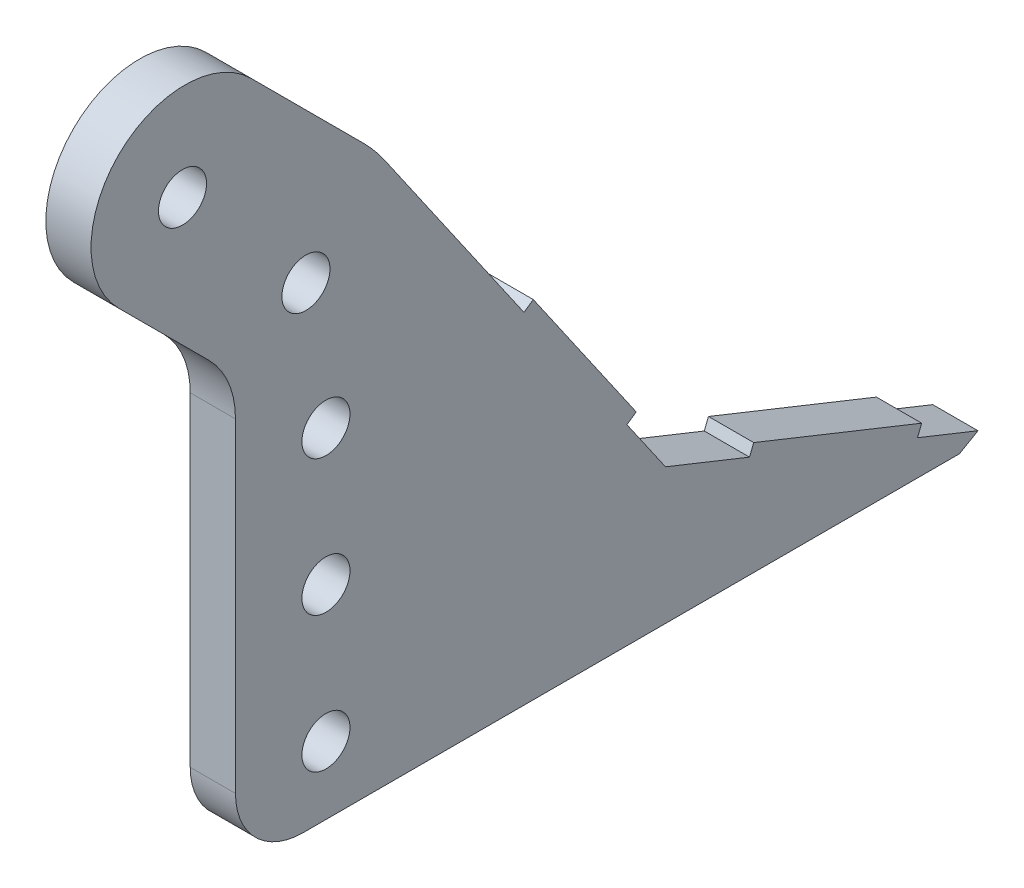
ISO-10303-21;
HEADER;
FILE_DESCRIPTION(('STEP AP214'),'2;1');
FILE_NAME('part.step','',(''),(''),'','','');
FILE_SCHEMA(('AUTOMOTIVE_DESIGN { 1 0 10303 214 1 1 1 1 }'));
ENDSEC;
DATA;
#1=APPLICATION_CONTEXT('core data for automotive mechanical design processes');
#2=APPLICATION_PROTOCOL_DEFINITION('international standard','automotive_design',2000,#1);
#3=PRODUCT_CONTEXT('',#1,'mechanical');
#4=PRODUCT('Part','Part','',(#3));
#5=PRODUCT_RELATED_PRODUCT_CATEGORY('part','',(#4));
#6=PRODUCT_DEFINITION_FORMATION('','',#4);
#7=PRODUCT_DEFINITION_CONTEXT('part definition',#1,'design');
#8=PRODUCT_DEFINITION('design','',#6,#7);
#9=PRODUCT_DEFINITION_SHAPE('','',#8);
#10=(LENGTH_UNIT() NAMED_UNIT(*) SI_UNIT(.MILLI.,.METRE.));
#11=(NAMED_UNIT(*) PLANE_ANGLE_UNIT() SI_UNIT($,.RADIAN.));
#12=(NAMED_UNIT(*) SI_UNIT($,.STERADIAN.) SOLID_ANGLE_UNIT());
#13=UNCERTAINTY_MEASURE_WITH_UNIT(LENGTH_MEASURE(1.E-05),#10,'distance_accuracy_value','');
#14=(GEOMETRIC_REPRESENTATION_CONTEXT(3) GLOBAL_UNCERTAINTY_ASSIGNED_CONTEXT((#13)) GLOBAL_UNIT_ASSIGNED_CONTEXT((#10,
#11,#12)) REPRESENTATION_CONTEXT('',''));
#15=CARTESIAN_POINT('',(0.,0.,0.));
#16=DIRECTION('',(0.,0.,1.));
#17=DIRECTION('',(1.,0.,0.));
#18=AXIS2_PLACEMENT_3D('',#15,#16,#17);
#19=CARTESIAN_POINT('',(-231.198104913253,-254.,-555.730407277116));
#20=DIRECTION('',(0.,0.928476690885259,-0.371390676354104));
#21=DIRECTION('',(0.,0.371390676354104,0.928476690885259));
#22=AXIS2_PLACEMENT_3D('',#19,#20,#21);
#23=PLANE('',#22);
#24=DIRECTION('',(1.,0.,0.));
#25=VECTOR('',#24,1.);
#26=CARTESIAN_POINT('',(-53.7828468557932,-225.333323179394,-484.063715225601));
#27=LINE('',#26,#25);
#28=CARTESIAN_POINT('',(0.,-225.333323179394,-484.063715225601));
#29=VERTEX_POINT('',#28);
#30=CARTESIAN_POINT('',(12.7,-225.333323179394,-484.063715225601));
#31=VERTEX_POINT('',#30);
#32=EDGE_CURVE('E402',#29,#31,#27,.T.);
#33=ORIENTED_EDGE('',*,*,#32,.F.);
#34=DIRECTION('',(0.,-0.371390676354104,-0.928476690885259));
#35=VECTOR('',#34,1.);
#36=CARTESIAN_POINT('',(0.,-254.,-555.730407277116));
#37=LINE('',#36,#35);
#38=CARTESIAN_POINT('',(0.,-215.9,-460.480407277116));
#39=VERTEX_POINT('',#38);
#40=EDGE_CURVE('E221',#39,#29,#37,.T.);
#41=ORIENTED_EDGE('',*,*,#40,.F.);
#42=DIRECTION('',(1.,0.,0.));
#43=VECTOR('',#42,1.);
#44=CARTESIAN_POINT('',(-231.198104913253,-215.9,-460.480407277116));
#45=LINE('',#44,#43);
#46=CARTESIAN_POINT('',(12.7,-215.9,-460.480407277116));
#47=VERTEX_POINT('',#46);
#48=EDGE_CURVE('E232',#39,#47,#45,.T.);
#49=ORIENTED_EDGE('',*,*,#48,.T.);
#50=DIRECTION('',(0.,0.371390676354104,0.928476690885259));
#51=VECTOR('',#50,1.);
#52=CARTESIAN_POINT('',(12.7,-254.,-555.730407277116));
#53=LINE('',#52,#51);
#54=EDGE_CURVE('E171',#31,#47,#53,.T.);
#55=ORIENTED_EDGE('',*,*,#54,.F.);
#56=EDGE_LOOP('',(#33,#41,#49,#55));
#57=FACE_BOUND('',#56,.T.);
#58=ADVANCED_FACE('F36',(#57),#23,.T.);
#59=CARTESIAN_POINT('',(-231.198104913253,-215.9,-460.480407277116));
#60=DIRECTION('',(0.,0.568989669090056,-0.822344670116362));
#61=DIRECTION('',(0.,0.822344670116362,0.568989669090056));
#62=AXIS2_PLACEMENT_3D('',#59,#60,#61);
#63=PLANE('',#62);
#64=DIRECTION('',(1.,0.,0.));
#65=VECTOR('',#64,1.);
#66=CARTESIAN_POINT('',(-53.7828468557932,-158.459224792372,-420.736478891175));
#67=LINE('',#66,#65);
#68=CARTESIAN_POINT('',(0.,-158.459224792372,-420.736478891175));
#69=VERTEX_POINT('',#68);
#70=CARTESIAN_POINT('',(12.7,-158.459224792372,-420.736478891175));
#71=VERTEX_POINT('',#70);
#72=EDGE_CURVE('E200',#69,#71,#67,.T.);
#73=ORIENTED_EDGE('',*,*,#72,.F.);
#74=DIRECTION('',(0.,-0.822344670116362,-0.568989669090056));
#75=VECTOR('',#74,1.);
#76=CARTESIAN_POINT('',(0.,-215.9,-460.480407277116));
#77=LINE('',#76,#75);
#78=CARTESIAN_POINT('',(0.,-101.904352021621,-381.605516519027));
#79=VERTEX_POINT('',#78);
#80=EDGE_CURVE('E225',#79,#69,#77,.T.);
#81=ORIENTED_EDGE('',*,*,#80,.F.);
#82=DIRECTION('',(1.,0.,0.));
#83=VECTOR('',#82,1.);
#84=CARTESIAN_POINT('',(-231.198104913253,-101.904352021621,-381.605516519027));
#85=LINE('',#84,#83);
#86=CARTESIAN_POINT('',(12.7,-101.904352021621,-381.605516519027));
#87=VERTEX_POINT('',#86);
#88=EDGE_CURVE('E233',#79,#87,#85,.T.);
#89=ORIENTED_EDGE('',*,*,#88,.T.);
#90=DIRECTION('',(0.,0.822344670116362,0.568989669090056));
#91=VECTOR('',#90,1.);
#92=CARTESIAN_POINT('',(12.7,-215.9,-460.480407277116));
#93=LINE('',#92,#91);
#94=EDGE_CURVE('E170',#71,#87,#93,.T.);
#95=ORIENTED_EDGE('',*,*,#94,.F.);
#96=EDGE_LOOP('',(#73,#81,#89,#95));
#97=FACE_BOUND('',#96,.T.);
#98=ADVANCED_FACE('F350',(#97),#63,.T.);
#99=CARTESIAN_POINT('',(12.7,103.1875,-103.187499999999));
#100=DIRECTION('',(0.,0.707106781186549,-0.707106781186546));
#101=DIRECTION('',(0.,0.707106781186546,0.707106781186549));
#102=AXIS2_PLACEMENT_3D('',#99,#100,#101);
#103=PLANE('',#102);
#104=DIRECTION('',(1.,0.,0.));
#105=VECTOR('',#104,1.);
#106=CARTESIAN_POINT('',(0.,-100.510512242138,-306.885512242138));
#107=LINE('',#106,#105);
#108=CARTESIAN_POINT('',(0.,-100.510512242138,-306.885512242138));
#109=VERTEX_POINT('',#108);
#110=CARTESIAN_POINT('',(12.7,-100.510512242138,-306.885512242138));
#111=VERTEX_POINT('',#110);
#112=EDGE_CURVE('E243',#109,#111,#107,.T.);
#113=ORIENTED_EDGE('',*,*,#112,.F.);
#114=DIRECTION('',(0.,-0.707106781186546,-0.707106781186549));
#115=VECTOR('',#114,1.);
#116=CARTESIAN_POINT('',(0.,103.1875,-103.187499999999));
#117=LINE('',#116,#115);
#118=CARTESIAN_POINT('',(0.,-125.910512242138,-332.285512242138));
#119=VERTEX_POINT('',#118);
#120=EDGE_CURVE('E285',#109,#119,#117,.T.);
#121=ORIENTED_EDGE('',*,*,#120,.T.);
#122=DIRECTION('',(-1.,0.,0.));
#123=VECTOR('',#122,1.);
#124=CARTESIAN_POINT('',(12.7,-125.910512242138,-332.285512242138));
#125=LINE('',#124,#123);
#126=CARTESIAN_POINT('',(12.7,-125.910512242138,-332.285512242138));
#127=VERTEX_POINT('',#126);
#128=EDGE_CURVE('E297',#119,#127,#125,.F.);
#129=ORIENTED_EDGE('',*,*,#128,.T.);
#130=DIRECTION('',(0.,-0.707106781186546,-0.707106781186549));
#131=VECTOR('',#130,1.);
#132=CARTESIAN_POINT('',(12.7,103.1875,-103.187499999999));
#133=LINE('',#132,#131);
#134=EDGE_CURVE('E273',#111,#127,#133,.T.);
#135=ORIENTED_EDGE('',*,*,#134,.F.);
#136=EDGE_LOOP('',(#113,#121,#129,#135));
#137=FACE_BOUND('',#136,.T.);
#138=ADVANCED_FACE('F357',(#137),#103,.F.);
#139=CARTESIAN_POINT('',(12.7,0.,0.));
#140=DIRECTION('',(1.,0.,0.));
#141=DIRECTION('',(0.,0.,-1.));
#142=AXIS2_PLACEMENT_3D('',#139,#140,#141);
#143=PLANE('',#142);
#144=CARTESIAN_POINT('',(12.7,-82.55,-324.846024484277));
#145=DIRECTION('',(1.,0.,0.));
#146=DIRECTION('',(0.,0.,-1.));
#147=AXIS2_PLACEMENT_3D('',#144,#145,#146);
#148=CIRCLE('',#147,6.74624);
#149=CARTESIAN_POINT('',(12.7,-82.55,-331.592264484277));
#150=VERTEX_POINT('',#149);
#151=EDGE_CURVE('E269',#150,#150,#148,.T.);
#152=ORIENTED_EDGE('',*,*,#151,.F.);
#153=EDGE_LOOP('',(#152));
#154=FACE_BOUND('',#153,.T.);
#155=CARTESIAN_POINT('',(12.7,-120.65,-359.507120599864));
#156=DIRECTION('',(1.,0.,0.));
#157=DIRECTION('',(0.,0.,-1.));
#158=AXIS2_PLACEMENT_3D('',#155,#156,#157);
#159=CIRCLE('',#158,6.74624);
#160=CARTESIAN_POINT('',(12.7,-120.65,-366.253360599864));
#161=VERTEX_POINT('',#160);
#162=EDGE_CURVE('E263',#161,#161,#159,.T.);
#163=ORIENTED_EDGE('',*,*,#162,.F.);
#164=EDGE_LOOP('',(#163));
#165=FACE_BOUND('',#164,.T.);
#166=CARTESIAN_POINT('',(12.7,-158.75,-365.125));
#167=DIRECTION('',(1.,0.,0.));
#168=DIRECTION('',(0.,0.,-1.));
#169=AXIS2_PLACEMENT_3D('',#166,#167,#168);
#170=CIRCLE('',#169,6.74623999999999);
#171=CARTESIAN_POINT('',(12.7,-158.75,-371.87124));
#172=VERTEX_POINT('',#171);
#173=EDGE_CURVE('E259',#172,#172,#170,.T.);
#174=ORIENTED_EDGE('',*,*,#173,.F.);
#175=EDGE_LOOP('',(#174));
#176=FACE_BOUND('',#175,.T.);
#177=CARTESIAN_POINT('',(12.7,-196.85,-365.125));
#178=DIRECTION('',(1.,0.,0.));
#179=DIRECTION('',(0.,0.,-1.));
#180=AXIS2_PLACEMENT_3D('',#177,#178,#179);
#181=CIRCLE('',#180,6.74623999999999);
#182=CARTESIAN_POINT('',(12.7,-196.85,-371.87124));
#183=VERTEX_POINT('',#182);
#184=EDGE_CURVE('E253',#183,#183,#181,.T.);
#185=ORIENTED_EDGE('',*,*,#184,.F.);
#186=EDGE_LOOP('',(#185));
#187=FACE_BOUND('',#186,.T.);
#188=CARTESIAN_POINT('',(12.7,-234.95,-365.125));
#189=DIRECTION('',(1.,0.,0.));
#190=DIRECTION('',(0.,0.,-1.));
#191=AXIS2_PLACEMENT_3D('',#188,#189,#190);
#192=CIRCLE('',#191,6.74623999999999);
#193=CARTESIAN_POINT('',(12.7,-234.95,-371.87124));
#194=VERTEX_POINT('',#193);
#195=EDGE_CURVE('E245',#194,#194,#192,.T.);
#196=ORIENTED_EDGE('',*,*,#195,.F.);
#197=EDGE_LOOP('',(#196));
#198=FACE_BOUND('',#197,.T.);
#199=DIRECTION('',(0.,0.,-1.));
#200=VECTOR('',#199,1.);
#201=CARTESIAN_POINT('',(12.7,-254.,0.));
#202=LINE('',#201,#200);
#203=CARTESIAN_POINT('',(12.7,-254.,-358.775));
#204=VERTEX_POINT('',#203);
#205=CARTESIAN_POINT('',(12.7,-254.,-543.030407277116));
#206=VERTEX_POINT('',#205);
#207=EDGE_CURVE('E279',#204,#206,#202,.T.);
#208=ORIENTED_EDGE('',*,*,#207,.T.);
#209=DIRECTION('',(0.,0.500000000000001,-0.866025403784438));
#210=VECTOR('',#209,1.);
#211=CARTESIAN_POINT('',(12.7,-425.639063864696,-245.742828099903));
#212=LINE('',#211,#210);
#213=CARTESIAN_POINT('',(12.7,-250.999090848038,-548.228134397212));
#214=VERTEX_POINT('',#213);
#215=EDGE_CURVE('E58',#206,#214,#212,.T.);
#216=ORIENTED_EDGE('',*,*,#215,.T.);
#217=CARTESIAN_POINT('',(12.7,-244.199969538183,-531.230331122572));
#218=VERTEX_POINT('',#217);
#219=EDGE_CURVE('E164',#214,#218,#53,.T.);
#220=ORIENTED_EDGE('',*,*,#219,.T.);
#221=DIRECTION('',(0.,0.928476690885218,-0.371390676354206));
#222=VECTOR('',#221,1.);
#223=CARTESIAN_POINT('',(12.7,-241.252056044622,-532.409496519997));
#224=LINE('',#223,#222);
#225=CARTESIAN_POINT('',(12.7,-241.252056044622,-532.409496519997));
#226=VERTEX_POINT('',#225);
#227=EDGE_CURVE('E168',#218,#226,#224,.T.);
#228=ORIENTED_EDGE('',*,*,#227,.T.);
#229=DIRECTION('',(0.,0.371390676354105,0.928476690885259));
#230=VECTOR('',#229,1.);
#231=CARTESIAN_POINT('',(12.7,-222.385409685834,-485.242880623026));
#232=LINE('',#231,#230);
#233=CARTESIAN_POINT('',(12.7,-222.385409685834,-485.242880623026));
#234=VERTEX_POINT('',#233);
#235=EDGE_CURVE('E181',#226,#234,#232,.T.);
#236=ORIENTED_EDGE('',*,*,#235,.T.);
#237=DIRECTION('',(0.,-0.928476690885257,0.37139067635411));
#238=VECTOR('',#237,1.);
#239=CARTESIAN_POINT('',(12.7,-225.333323179394,-484.063715225601));
#240=LINE('',#239,#238);
#241=EDGE_CURVE('E185',#234,#31,#240,.T.);
#242=ORIENTED_EDGE('',*,*,#241,.T.);
#243=ORIENTED_EDGE('',*,*,#54,.T.);
#244=CARTESIAN_POINT('',(12.7,-200.234334034283,-449.64115408095));
#245=VERTEX_POINT('',#244);
#246=EDGE_CURVE('E229',#47,#245,#93,.T.);
#247=ORIENTED_EDGE('',*,*,#246,.T.);
#248=DIRECTION('',(0.,0.568989669090058,-0.822344670116361));
#249=VECTOR('',#248,1.);
#250=CARTESIAN_POINT('',(12.7,-200.234334034283,-449.64115408095));
#251=LINE('',#250,#249);
#252=CARTESIAN_POINT('',(12.7,-198.427791834922,-452.25209840857));
#253=VERTEX_POINT('',#252);
#254=EDGE_CURVE('E195',#245,#253,#251,.T.);
#255=ORIENTED_EDGE('',*,*,#254,.T.);
#256=DIRECTION('',(0.,0.822344670116361,0.568989669090057));
#257=VECTOR('',#256,1.);
#258=CARTESIAN_POINT('',(12.7,-198.427791834922,-452.25209840857));
#259=LINE('',#258,#257);
#260=CARTESIAN_POINT('',(12.7,-156.652682593011,-423.347423218795));
#261=VERTEX_POINT('',#260);
#262=EDGE_CURVE('E205',#253,#261,#259,.T.);
#263=ORIENTED_EDGE('',*,*,#262,.T.);
#264=DIRECTION('',(0.,-0.568989669090055,0.822344670116363));
#265=VECTOR('',#264,1.);
#266=CARTESIAN_POINT('',(12.7,-156.652682593011,-423.347423218795));
#267=LINE('',#266,#265);
#268=EDGE_CURVE('E208',#261,#71,#267,.T.);
#269=ORIENTED_EDGE('',*,*,#268,.T.);
#270=ORIENTED_EDGE('',*,*,#94,.T.);
#271=CARTESIAN_POINT('',(12.7,-130.809027211395,-339.830407277116));
#272=DIRECTION('',(1.,0.,0.));
#273=DIRECTION('',(0.,0.,-1.));
#274=AXIS2_PLACEMENT_3D('',#271,#272,#273);
#275=CIRCLE('',#274,50.8);
#276=CARTESIAN_POINT('',(12.7,-94.8880027271187,-375.751431761392));
#277=VERTEX_POINT('',#276);
#278=EDGE_CURVE('E311',#87,#277,#275,.T.);
#279=ORIENTED_EDGE('',*,*,#278,.T.);
#280=DIRECTION('',(0.,0.707106781186546,0.707106781186549));
#281=VECTOR('',#280,1.);
#282=CARTESIAN_POINT('',(12.7,140.431714517137,-140.431714517136));
#283=LINE('',#282,#281);
#284=CARTESIAN_POINT('',(12.7,-63.2662977250012,-344.129726759275));
#285=VERTEX_POINT('',#284);
#286=EDGE_CURVE('E281',#277,#285,#283,.T.);
#287=ORIENTED_EDGE('',*,*,#286,.T.);
#288=CARTESIAN_POINT('',(12.7,-81.8884049835699,-325.507619500707));
#289=DIRECTION('',(1.,0.,0.));
#290=DIRECTION('',(0.,0.,-1.));
#291=AXIS2_PLACEMENT_3D('',#288,#289,#290);
#292=CIRCLE('',#291,26.335636645034);
#293=EDGE_CURVE('E227',#285,#111,#292,.T.);
#294=ORIENTED_EDGE('',*,*,#293,.T.);
#295=ORIENTED_EDGE('',*,*,#134,.T.);
#296=CARTESIAN_POINT('',(12.7,-143.871024484277,-314.325));
#297=DIRECTION('',(1.,0.,0.));
#298=DIRECTION('',(0.,0.,-1.));
#299=AXIS2_PLACEMENT_3D('',#296,#297,#298);
#300=CIRCLE('',#299,25.4);
#301=CARTESIAN_POINT('',(12.7,-143.871024484277,-339.725));
#302=VERTEX_POINT('',#301);
#303=EDGE_CURVE('E303',#127,#302,#300,.F.);
#304=ORIENTED_EDGE('',*,*,#303,.T.);
#305=DIRECTION('',(0.,-1.,0.));
#306=VECTOR('',#305,1.);
#307=CARTESIAN_POINT('',(12.7,-1.56307715309068E-13,-339.725));
#308=LINE('',#307,#306);
#309=CARTESIAN_POINT('',(12.7,-234.95,-339.725));
#310=VERTEX_POINT('',#309);
#311=EDGE_CURVE('E275',#302,#310,#308,.T.);
#312=ORIENTED_EDGE('',*,*,#311,.T.);
#313=CARTESIAN_POINT('',(12.7,-234.95,-358.775));
#314=DIRECTION('',(1.,0.,0.));
#315=DIRECTION('',(0.,0.,-1.));
#316=AXIS2_PLACEMENT_3D('',#313,#314,#315);
#317=CIRCLE('',#316,19.05);
#318=EDGE_CURVE('E324',#310,#204,#317,.T.);
#319=ORIENTED_EDGE('',*,*,#318,.T.);
#320=EDGE_LOOP('',(#208,#216,#220,#228,#236,#242,#243,#247,#255,#263,#269,#270,#279,#287,#294,
#295,#304,#312,#319));
#321=FACE_BOUND('',#320,.T.);
#322=ADVANCED_FACE('F166',(#154,#165,#176,#187,#198,#321),#143,.T.);
#323=CARTESIAN_POINT('',(0.,0.,0.));
#324=DIRECTION('',(1.,0.,0.));
#325=DIRECTION('',(0.,0.,-1.));
#326=AXIS2_PLACEMENT_3D('',#323,#324,#325);
#327=PLANE('',#326);
#328=CARTESIAN_POINT('',(0.,-82.55,-324.846024484277));
#329=DIRECTION('',(1.,0.,0.));
#330=DIRECTION('',(0.,0.,-1.));
#331=AXIS2_PLACEMENT_3D('',#328,#329,#330);
#332=CIRCLE('',#331,6.74623999999999);
#333=CARTESIAN_POINT('',(0.,-82.55,-331.592264484277));
#334=VERTEX_POINT('',#333);
#335=EDGE_CURVE('E272',#334,#334,#332,.T.);
#336=ORIENTED_EDGE('',*,*,#335,.T.);
#337=EDGE_LOOP('',(#336));
#338=FACE_BOUND('',#337,.T.);
#339=CARTESIAN_POINT('',(0.,-120.65,-359.507120599864));
#340=DIRECTION('',(1.,0.,0.));
#341=DIRECTION('',(0.,0.,-1.));
#342=AXIS2_PLACEMENT_3D('',#339,#340,#341);
#343=CIRCLE('',#342,6.74623999999999);
#344=CARTESIAN_POINT('',(0.,-120.65,-366.253360599864));
#345=VERTEX_POINT('',#344);
#346=EDGE_CURVE('E266',#345,#345,#343,.T.);
#347=ORIENTED_EDGE('',*,*,#346,.T.);
#348=EDGE_LOOP('',(#347));
#349=FACE_BOUND('',#348,.T.);
#350=CARTESIAN_POINT('',(0.,-158.75,-365.125));
#351=DIRECTION('',(1.,0.,0.));
#352=DIRECTION('',(0.,0.,-1.));
#353=AXIS2_PLACEMENT_3D('',#350,#351,#352);
#354=CIRCLE('',#353,6.74623999999999);
#355=CARTESIAN_POINT('',(0.,-158.75,-371.87124));
#356=VERTEX_POINT('',#355);
#357=EDGE_CURVE('E262',#356,#356,#354,.T.);
#358=ORIENTED_EDGE('',*,*,#357,.T.);
#359=EDGE_LOOP('',(#358));
#360=FACE_BOUND('',#359,.T.);
#361=CARTESIAN_POINT('',(0.,-196.85,-365.125));
#362=DIRECTION('',(1.,0.,0.));
#363=DIRECTION('',(0.,0.,-1.));
#364=AXIS2_PLACEMENT_3D('',#361,#362,#363);
#365=CIRCLE('',#364,6.74623999999999);
#366=CARTESIAN_POINT('',(0.,-196.85,-371.87124));
#367=VERTEX_POINT('',#366);
#368=EDGE_CURVE('E256',#367,#367,#365,.T.);
#369=ORIENTED_EDGE('',*,*,#368,.T.);
#370=EDGE_LOOP('',(#369));
#371=FACE_BOUND('',#370,.T.);
#372=CARTESIAN_POINT('',(0.,-234.95,-365.125));
#373=DIRECTION('',(1.,0.,0.));
#374=DIRECTION('',(0.,0.,-1.));
#375=AXIS2_PLACEMENT_3D('',#372,#373,#374);
#376=CIRCLE('',#375,6.74623999999999);
#377=CARTESIAN_POINT('',(0.,-234.95,-371.87124));
#378=VERTEX_POINT('',#377);
#379=EDGE_CURVE('E250',#378,#378,#376,.T.);
#380=ORIENTED_EDGE('',*,*,#379,.T.);
#381=EDGE_LOOP('',(#380));
#382=FACE_BOUND('',#381,.T.);
#383=CARTESIAN_POINT('',(0.,-244.199969538183,-531.230331122572));
#384=VERTEX_POINT('',#383);
#385=CARTESIAN_POINT('',(0.,-250.999090848038,-548.228134397212));
#386=VERTEX_POINT('',#385);
#387=EDGE_CURVE('E184',#384,#386,#37,.T.);
#388=ORIENTED_EDGE('',*,*,#387,.T.);
#389=DIRECTION('',(0.,-0.500000000000001,0.866025403784438));
#390=VECTOR('',#389,1.);
#391=CARTESIAN_POINT('',(0.,-254.,-543.030407277116));
#392=LINE('',#391,#390);
#393=CARTESIAN_POINT('',(0.,-254.,-543.030407277115));
#394=VERTEX_POINT('',#393);
#395=EDGE_CURVE('E11',#386,#394,#392,.T.);
#396=ORIENTED_EDGE('',*,*,#395,.T.);
#397=DIRECTION('',(0.,0.,-1.));
#398=VECTOR('',#397,1.);
#399=CARTESIAN_POINT('',(0.,-254.,0.));
#400=LINE('',#399,#398);
#401=CARTESIAN_POINT('',(0.,-254.,-358.775));
#402=VERTEX_POINT('',#401);
#403=EDGE_CURVE('E290',#402,#394,#400,.T.);
#404=ORIENTED_EDGE('',*,*,#403,.F.);
#405=CARTESIAN_POINT('',(0.,-234.95,-358.775));
#406=DIRECTION('',(1.,0.,0.));
#407=DIRECTION('',(0.,0.,-1.));
#408=AXIS2_PLACEMENT_3D('',#405,#406,#407);
#409=CIRCLE('',#408,19.05);
#410=CARTESIAN_POINT('',(0.,-234.95,-339.725));
#411=VERTEX_POINT('',#410);
#412=EDGE_CURVE('E320',#402,#411,#409,.F.);
#413=ORIENTED_EDGE('',*,*,#412,.T.);
#414=DIRECTION('',(0.,-1.,0.));
#415=VECTOR('',#414,1.);
#416=CARTESIAN_POINT('',(0.,-1.56307715309068E-13,-339.725));
#417=LINE('',#416,#415);
#418=CARTESIAN_POINT('',(0.,-143.871024484277,-339.725));
#419=VERTEX_POINT('',#418);
#420=EDGE_CURVE('E287',#419,#411,#417,.T.);
#421=ORIENTED_EDGE('',*,*,#420,.F.);
#422=CARTESIAN_POINT('',(0.,-143.871024484277,-314.325));
#423=DIRECTION('',(1.,0.,0.));
#424=DIRECTION('',(0.,0.,-1.));
#425=AXIS2_PLACEMENT_3D('',#422,#423,#424);
#426=CIRCLE('',#425,25.4);
#427=EDGE_CURVE('E300',#419,#119,#426,.T.);
#428=ORIENTED_EDGE('',*,*,#427,.T.);
#429=ORIENTED_EDGE('',*,*,#120,.F.);
#430=CARTESIAN_POINT('',(0.,-81.8884049835699,-325.507619500707));
#431=DIRECTION('',(1.,0.,0.));
#432=DIRECTION('',(0.,0.,-1.));
#433=AXIS2_PLACEMENT_3D('',#430,#431,#432);
#434=CIRCLE('',#433,26.335636645034);
#435=CARTESIAN_POINT('',(0.,-63.2662977250012,-344.129726759275));
#436=VERTEX_POINT('',#435);
#437=EDGE_CURVE('E238',#436,#109,#434,.T.);
#438=ORIENTED_EDGE('',*,*,#437,.F.);
#439=DIRECTION('',(0.,0.707106781186546,0.707106781186549));
#440=VECTOR('',#439,1.);
#441=CARTESIAN_POINT('',(0.,140.431714517137,-140.431714517136));
#442=LINE('',#441,#440);
#443=CARTESIAN_POINT('',(0.,-94.8880027271187,-375.751431761392));
#444=VERTEX_POINT('',#443);
#445=EDGE_CURVE('E276',#444,#436,#442,.T.);
#446=ORIENTED_EDGE('',*,*,#445,.F.);
#447=CARTESIAN_POINT('',(0.,-130.809027211395,-339.830407277116));
#448=DIRECTION('',(1.,0.,0.));
#449=DIRECTION('',(0.,0.,-1.));
#450=AXIS2_PLACEMENT_3D('',#447,#448,#449);
#451=CIRCLE('',#450,50.8);
#452=EDGE_CURVE('E308',#444,#79,#451,.F.);
#453=ORIENTED_EDGE('',*,*,#452,.T.);
#454=ORIENTED_EDGE('',*,*,#80,.T.);
#455=DIRECTION('',(0.,0.568989669090055,-0.822344670116363));
#456=VECTOR('',#455,1.);
#457=CARTESIAN_POINT('',(0.,-156.652682593011,-423.347423218795));
#458=LINE('',#457,#456);
#459=CARTESIAN_POINT('',(0.,-156.652682593011,-423.347423218795));
#460=VERTEX_POINT('',#459);
#461=EDGE_CURVE('E199',#69,#460,#458,.T.);
#462=ORIENTED_EDGE('',*,*,#461,.T.);
#463=DIRECTION('',(0.,-0.822344670116361,-0.568989669090057));
#464=VECTOR('',#463,1.);
#465=CARTESIAN_POINT('',(0.,-198.427791834922,-452.25209840857));
#466=LINE('',#465,#464);
#467=CARTESIAN_POINT('',(0.,-198.427791834922,-452.25209840857));
#468=VERTEX_POINT('',#467);
#469=EDGE_CURVE('E197',#460,#468,#466,.T.);
#470=ORIENTED_EDGE('',*,*,#469,.T.);
#471=DIRECTION('',(0.,-0.568989669090058,0.822344670116361));
#472=VECTOR('',#471,1.);
#473=CARTESIAN_POINT('',(0.,-200.234334034283,-449.64115408095));
#474=LINE('',#473,#472);
#475=CARTESIAN_POINT('',(0.,-200.234334034283,-449.64115408095));
#476=VERTEX_POINT('',#475);
#477=EDGE_CURVE('E202',#468,#476,#474,.T.);
#478=ORIENTED_EDGE('',*,*,#477,.T.);
#479=EDGE_CURVE('E224',#476,#39,#77,.T.);
#480=ORIENTED_EDGE('',*,*,#479,.T.);
#481=ORIENTED_EDGE('',*,*,#40,.T.);
#482=DIRECTION('',(0.,0.928476690885257,-0.37139067635411));
#483=VECTOR('',#482,1.);
#484=CARTESIAN_POINT('',(0.,-225.333323179394,-484.063715225601));
#485=LINE('',#484,#483);
#486=CARTESIAN_POINT('',(0.,-222.385409685834,-485.242880623026));
#487=VERTEX_POINT('',#486);
#488=EDGE_CURVE('E196',#29,#487,#485,.T.);
#489=ORIENTED_EDGE('',*,*,#488,.T.);
#490=DIRECTION('',(0.,-0.371390676354105,-0.928476690885259));
#491=VECTOR('',#490,1.);
#492=CARTESIAN_POINT('',(0.,-222.385409685834,-485.242880623026));
#493=LINE('',#492,#491);
#494=CARTESIAN_POINT('',(0.,-241.252056044622,-532.409496519997));
#495=VERTEX_POINT('',#494);
#496=EDGE_CURVE('E404',#487,#495,#493,.T.);
#497=ORIENTED_EDGE('',*,*,#496,.T.);
#498=DIRECTION('',(0.,-0.928476690885218,0.371390676354206));
#499=VECTOR('',#498,1.);
#500=CARTESIAN_POINT('',(0.,-241.252056044622,-532.409496519997));
#501=LINE('',#500,#499);
#502=EDGE_CURVE('E193',#495,#384,#501,.T.);
#503=ORIENTED_EDGE('',*,*,#502,.T.);
#504=EDGE_LOOP('',(#388,#396,#404,#413,#421,#428,#429,#438,#446,#453,#454,#462,#470,#478,#480,
#481,#489,#497,#503));
#505=FACE_BOUND('',#504,.T.);
#506=ADVANCED_FACE('F343',(#338,#349,#360,#371,#382,#505),#327,.F.);
#507=CARTESIAN_POINT('',(12.7,-1.56307715309068E-13,-339.725));
#508=DIRECTION('',(0.,0.,-1.));
#509=DIRECTION('',(0.,1.,0.));
#510=AXIS2_PLACEMENT_3D('',#507,#508,#509);
#511=PLANE('',#510);
#512=ORIENTED_EDGE('',*,*,#420,.T.);
#513=DIRECTION('',(-1.,0.,0.));
#514=VECTOR('',#513,1.);
#515=CARTESIAN_POINT('',(12.7,-234.95,-339.725));
#516=LINE('',#515,#514);
#517=EDGE_CURVE('E322',#411,#310,#516,.F.);
#518=ORIENTED_EDGE('',*,*,#517,.T.);
#519=ORIENTED_EDGE('',*,*,#311,.F.);
#520=DIRECTION('',(-1.,0.,0.));
#521=VECTOR('',#520,1.);
#522=CARTESIAN_POINT('',(0.,-143.871024484277,-339.725));
#523=LINE('',#522,#521);
#524=EDGE_CURVE('E284',#302,#419,#523,.T.);
#525=ORIENTED_EDGE('',*,*,#524,.T.);
#526=EDGE_LOOP('',(#512,#518,#519,#525));
#527=FACE_BOUND('',#526,.T.);
#528=ADVANCED_FACE('F441',(#527),#511,.F.);
#529=CARTESIAN_POINT('',(12.7,-254.,0.));
#530=DIRECTION('',(0.,1.,0.));
#531=DIRECTION('',(0.,0.,1.));
#532=AXIS2_PLACEMENT_3D('',#529,#530,#531);
#533=PLANE('',#532);
#534=ORIENTED_EDGE('',*,*,#403,.T.);
#535=DIRECTION('',(1.,0.,0.));
#536=VECTOR('',#535,1.);
#537=CARTESIAN_POINT('',(12.7,-254.,-543.030407277116));
#538=LINE('',#537,#536);
#539=EDGE_CURVE('E326',#394,#206,#538,.T.);
#540=ORIENTED_EDGE('',*,*,#539,.T.);
#541=ORIENTED_EDGE('',*,*,#207,.F.);
#542=DIRECTION('',(-1.,0.,0.));
#543=VECTOR('',#542,1.);
#544=CARTESIAN_POINT('',(12.7,-254.,-358.775));
#545=LINE('',#544,#543);
#546=EDGE_CURVE('E313',#204,#402,#545,.T.);
#547=ORIENTED_EDGE('',*,*,#546,.T.);
#548=EDGE_LOOP('',(#534,#540,#541,#547));
#549=FACE_BOUND('',#548,.T.);
#550=ADVANCED_FACE('F332',(#549),#533,.F.);
#551=CARTESIAN_POINT('',(12.7,140.431714517137,-140.431714517136));
#552=DIRECTION('',(0.,-0.707106781186549,0.707106781186546));
#553=DIRECTION('',(0.,-0.707106781186546,-0.707106781186549));
#554=AXIS2_PLACEMENT_3D('',#551,#552,#553);
#555=PLANE('',#554);
#556=ORIENTED_EDGE('',*,*,#445,.T.);
#557=DIRECTION('',(1.,0.,0.));
#558=VECTOR('',#557,1.);
#559=CARTESIAN_POINT('',(0.,-63.2662977250012,-344.129726759275));
#560=LINE('',#559,#558);
#561=EDGE_CURVE('E240',#436,#285,#560,.T.);
#562=ORIENTED_EDGE('',*,*,#561,.T.);
#563=ORIENTED_EDGE('',*,*,#286,.F.);
#564=DIRECTION('',(-1.,0.,0.));
#565=VECTOR('',#564,1.);
#566=CARTESIAN_POINT('',(12.7,-94.8880027271187,-375.751431761392));
#567=LINE('',#566,#565);
#568=EDGE_CURVE('E305',#277,#444,#567,.T.);
#569=ORIENTED_EDGE('',*,*,#568,.T.);
#570=EDGE_LOOP('',(#556,#562,#563,#569));
#571=FACE_BOUND('',#570,.T.);
#572=ADVANCED_FACE('F429',(#571),#555,.F.);
#573=CARTESIAN_POINT('',(12.7,-143.871024484277,-314.325));
#574=DIRECTION('',(1.,0.,0.));
#575=DIRECTION('',(0.,0.,-1.));
#576=AXIS2_PLACEMENT_3D('',#573,#574,#575);
#577=CYLINDRICAL_SURFACE('',#576,25.4);
#578=ORIENTED_EDGE('',*,*,#303,.F.);
#579=ORIENTED_EDGE('',*,*,#128,.F.);
#580=ORIENTED_EDGE('',*,*,#427,.F.);
#581=ORIENTED_EDGE('',*,*,#524,.F.);
#582=EDGE_LOOP('',(#578,#579,#580,#581));
#583=FACE_BOUND('',#582,.T.);
#584=ADVANCED_FACE('F442',(#583),#577,.F.);
#585=CARTESIAN_POINT('',(12.7,-130.809027211395,-339.830407277116));
#586=DIRECTION('',(-1.,0.,0.));
#587=DIRECTION('',(0.,0.,1.));
#588=AXIS2_PLACEMENT_3D('',#585,#586,#587);
#589=CYLINDRICAL_SURFACE('',#588,50.8);
#590=ORIENTED_EDGE('',*,*,#88,.F.);
#591=ORIENTED_EDGE('',*,*,#452,.F.);
#592=ORIENTED_EDGE('',*,*,#568,.F.);
#593=ORIENTED_EDGE('',*,*,#278,.F.);
#594=EDGE_LOOP('',(#590,#591,#592,#593));
#595=FACE_BOUND('',#594,.T.);
#596=ADVANCED_FACE('F426',(#595),#589,.T.);
#597=CARTESIAN_POINT('',(12.7,-82.55,-324.846024484277));
#598=DIRECTION('',(1.,0.,0.));
#599=DIRECTION('',(0.,0.,-1.));
#600=AXIS2_PLACEMENT_3D('',#597,#598,#599);
#601=CYLINDRICAL_SURFACE('',#600,6.74623999999999);
#602=ORIENTED_EDGE('',*,*,#151,.T.);
#603=EDGE_LOOP('',(#602));
#604=FACE_BOUND('',#603,.T.);
#605=ORIENTED_EDGE('',*,*,#335,.F.);
#606=EDGE_LOOP('',(#605));
#607=FACE_BOUND('',#606,.T.);
#608=ADVANCED_FACE('F449',(#604,#607),#601,.F.);
#609=CARTESIAN_POINT('',(12.7,-120.65,-359.507120599864));
#610=DIRECTION('',(1.,0.,0.));
#611=DIRECTION('',(0.,0.,-1.));
#612=AXIS2_PLACEMENT_3D('',#609,#610,#611);
#613=CYLINDRICAL_SURFACE('',#612,6.74623999999999);
#614=ORIENTED_EDGE('',*,*,#162,.T.);
#615=EDGE_LOOP('',(#614));
#616=FACE_BOUND('',#615,.T.);
#617=ORIENTED_EDGE('',*,*,#346,.F.);
#618=EDGE_LOOP('',(#617));
#619=FACE_BOUND('',#618,.T.);
#620=ADVANCED_FACE('F466',(#616,#619),#613,.F.);
#621=CARTESIAN_POINT('',(12.7,-158.75,-365.125));
#622=DIRECTION('',(1.,0.,0.));
#623=DIRECTION('',(0.,0.,-1.));
#624=AXIS2_PLACEMENT_3D('',#621,#622,#623);
#625=CYLINDRICAL_SURFACE('',#624,6.74623999999999);
#626=ORIENTED_EDGE('',*,*,#173,.T.);
#627=EDGE_LOOP('',(#626));
#628=FACE_BOUND('',#627,.T.);
#629=ORIENTED_EDGE('',*,*,#357,.F.);
#630=EDGE_LOOP('',(#629));
#631=FACE_BOUND('',#630,.T.);
#632=ADVANCED_FACE('F470',(#628,#631),#625,.F.);
#633=CARTESIAN_POINT('',(12.7,-196.85,-365.125));
#634=DIRECTION('',(1.,0.,0.));
#635=DIRECTION('',(0.,0.,-1.));
#636=AXIS2_PLACEMENT_3D('',#633,#634,#635);
#637=CYLINDRICAL_SURFACE('',#636,6.74623999999999);
#638=ORIENTED_EDGE('',*,*,#184,.T.);
#639=EDGE_LOOP('',(#638));
#640=FACE_BOUND('',#639,.T.);
#641=ORIENTED_EDGE('',*,*,#368,.F.);
#642=EDGE_LOOP('',(#641));
#643=FACE_BOUND('',#642,.T.);
#644=ADVANCED_FACE('F474',(#640,#643),#637,.F.);
#645=CARTESIAN_POINT('',(12.7,-234.95,-365.125));
#646=DIRECTION('',(1.,0.,0.));
#647=DIRECTION('',(0.,0.,-1.));
#648=AXIS2_PLACEMENT_3D('',#645,#646,#647);
#649=CYLINDRICAL_SURFACE('',#648,6.74623999999999);
#650=ORIENTED_EDGE('',*,*,#195,.T.);
#651=EDGE_LOOP('',(#650));
#652=FACE_BOUND('',#651,.T.);
#653=ORIENTED_EDGE('',*,*,#379,.F.);
#654=EDGE_LOOP('',(#653));
#655=FACE_BOUND('',#654,.T.);
#656=ADVANCED_FACE('F379',(#652,#655),#649,.F.);
#657=CARTESIAN_POINT('',(0.,-81.8884049835699,-325.507619500707));
#658=DIRECTION('',(1.,0.,0.));
#659=DIRECTION('',(0.,0.,-1.));
#660=AXIS2_PLACEMENT_3D('',#657,#658,#659);
#661=CYLINDRICAL_SURFACE('',#660,26.335636645034);
#662=ORIENTED_EDGE('',*,*,#293,.F.);
#663=ORIENTED_EDGE('',*,*,#561,.F.);
#664=ORIENTED_EDGE('',*,*,#437,.T.);
#665=ORIENTED_EDGE('',*,*,#112,.T.);
#666=EDGE_LOOP('',(#662,#663,#664,#665));
#667=FACE_BOUND('',#666,.T.);
#668=ADVANCED_FACE('F373',(#667),#661,.T.);
#669=DIRECTION('',(1.,0.,0.));
#670=VECTOR('',#669,1.);
#671=CARTESIAN_POINT('',(-53.7828468557932,-200.234334034283,-449.64115408095));
#672=LINE('',#671,#670);
#673=EDGE_CURVE('E211',#476,#245,#672,.T.);
#674=ORIENTED_EDGE('',*,*,#673,.T.);
#675=ORIENTED_EDGE('',*,*,#246,.F.);
#676=ORIENTED_EDGE('',*,*,#48,.F.);
#677=ORIENTED_EDGE('',*,*,#479,.F.);
#678=EDGE_LOOP('',(#674,#675,#676,#677));
#679=FACE_BOUND('',#678,.T.);
#680=ADVANCED_FACE('F360',(#679),#63,.T.);
#681=ORIENTED_EDGE('',*,*,#219,.F.);
#682=DIRECTION('',(-1.,0.,0.));
#683=VECTOR('',#682,1.);
#684=CARTESIAN_POINT('',(0.,-250.999090848038,-548.228134397212));
#685=LINE('',#684,#683);
#686=EDGE_CURVE('E44',#214,#386,#685,.T.);
#687=ORIENTED_EDGE('',*,*,#686,.T.);
#688=ORIENTED_EDGE('',*,*,#387,.F.);
#689=DIRECTION('',(1.,0.,0.));
#690=VECTOR('',#689,1.);
#691=CARTESIAN_POINT('',(-53.7828468557932,-244.199969538183,-531.230331122572));
#692=LINE('',#691,#690);
#693=EDGE_CURVE('E176',#384,#218,#692,.T.);
#694=ORIENTED_EDGE('',*,*,#693,.T.);
#695=EDGE_LOOP('',(#681,#687,#688,#694));
#696=FACE_BOUND('',#695,.T.);
#697=ADVANCED_FACE('F183',(#696),#23,.T.);
#698=CARTESIAN_POINT('',(-53.7828468557932,-156.652682593011,-423.347423218795));
#699=DIRECTION('',(0.,0.822344670116363,0.568989669090055));
#700=DIRECTION('',(0.,-0.568989669090055,0.822344670116363));
#701=AXIS2_PLACEMENT_3D('',#698,#699,#700);
#702=PLANE('',#701);
#703=ORIENTED_EDGE('',*,*,#461,.F.);
#704=ORIENTED_EDGE('',*,*,#72,.T.);
#705=ORIENTED_EDGE('',*,*,#268,.F.);
#706=DIRECTION('',(1.,0.,0.));
#707=VECTOR('',#706,1.);
#708=CARTESIAN_POINT('',(-53.7828468557932,-156.652682593011,-423.347423218795));
#709=LINE('',#708,#707);
#710=EDGE_CURVE('E213',#460,#261,#709,.T.);
#711=ORIENTED_EDGE('',*,*,#710,.F.);
#712=EDGE_LOOP('',(#703,#704,#705,#711));
#713=FACE_BOUND('',#712,.T.);
#714=ADVANCED_FACE('F364',(#713),#702,.T.);
#715=CARTESIAN_POINT('',(-53.7828468557932,-198.427791834922,-452.25209840857));
#716=DIRECTION('',(0.,0.568989669090057,-0.822344670116361));
#717=DIRECTION('',(0.,0.822344670116361,0.568989669090057));
#718=AXIS2_PLACEMENT_3D('',#715,#716,#717);
#719=PLANE('',#718);
#720=ORIENTED_EDGE('',*,*,#469,.F.);
#721=ORIENTED_EDGE('',*,*,#710,.T.);
#722=ORIENTED_EDGE('',*,*,#262,.F.);
#723=DIRECTION('',(1.,0.,0.));
#724=VECTOR('',#723,1.);
#725=CARTESIAN_POINT('',(-53.7828468557932,-198.427791834922,-452.25209840857));
#726=LINE('',#725,#724);
#727=EDGE_CURVE('E215',#468,#253,#726,.T.);
#728=ORIENTED_EDGE('',*,*,#727,.F.);
#729=EDGE_LOOP('',(#720,#721,#722,#728));
#730=FACE_BOUND('',#729,.T.);
#731=ADVANCED_FACE('F369',(#730),#719,.T.);
#732=CARTESIAN_POINT('',(-53.7828468557932,-200.234334034283,-449.64115408095));
#733=DIRECTION('',(0.,-0.822344670116361,-0.568989669090058));
#734=DIRECTION('',(0.,0.568989669090058,-0.822344670116361));
#735=AXIS2_PLACEMENT_3D('',#732,#733,#734);
#736=PLANE('',#735);
#737=ORIENTED_EDGE('',*,*,#477,.F.);
#738=ORIENTED_EDGE('',*,*,#727,.T.);
#739=ORIENTED_EDGE('',*,*,#254,.F.);
#740=ORIENTED_EDGE('',*,*,#673,.F.);
#741=EDGE_LOOP('',(#737,#738,#739,#740));
#742=FACE_BOUND('',#741,.T.);
#743=ADVANCED_FACE('F382',(#742),#736,.T.);
#744=CARTESIAN_POINT('',(-53.7828468557932,-225.333323179394,-484.063715225601));
#745=DIRECTION('',(0.,0.37139067635411,0.928476690885257));
#746=DIRECTION('',(0.,-0.928476690885257,0.37139067635411));
#747=AXIS2_PLACEMENT_3D('',#744,#745,#746);
#748=PLANE('',#747);
#749=ORIENTED_EDGE('',*,*,#488,.F.);
#750=ORIENTED_EDGE('',*,*,#32,.T.);
#751=ORIENTED_EDGE('',*,*,#241,.F.);
#752=DIRECTION('',(1.,0.,0.));
#753=VECTOR('',#752,1.);
#754=CARTESIAN_POINT('',(-53.7828468557932,-222.385409685834,-485.242880623026));
#755=LINE('',#754,#753);
#756=EDGE_CURVE('E187',#487,#234,#755,.T.);
#757=ORIENTED_EDGE('',*,*,#756,.F.);
#758=EDGE_LOOP('',(#749,#750,#751,#757));
#759=FACE_BOUND('',#758,.T.);
#760=ADVANCED_FACE('F385',(#759),#748,.T.);
#761=CARTESIAN_POINT('',(-53.7828468557932,-222.385409685834,-485.242880623026));
#762=DIRECTION('',(0.,0.928476690885259,-0.371390676354105));
#763=DIRECTION('',(0.,0.371390676354105,0.928476690885259));
#764=AXIS2_PLACEMENT_3D('',#761,#762,#763);
#765=PLANE('',#764);
#766=ORIENTED_EDGE('',*,*,#496,.F.);
#767=ORIENTED_EDGE('',*,*,#756,.T.);
#768=ORIENTED_EDGE('',*,*,#235,.F.);
#769=DIRECTION('',(1.,0.,0.));
#770=VECTOR('',#769,1.);
#771=CARTESIAN_POINT('',(-53.7828468557932,-241.252056044622,-532.409496519997));
#772=LINE('',#771,#770);
#773=EDGE_CURVE('E179',#495,#226,#772,.T.);
#774=ORIENTED_EDGE('',*,*,#773,.F.);
#775=EDGE_LOOP('',(#766,#767,#768,#774));
#776=FACE_BOUND('',#775,.T.);
#777=ADVANCED_FACE('F392',(#776),#765,.T.);
#778=CARTESIAN_POINT('',(-53.7828468557932,-241.252056044622,-532.409496519997));
#779=DIRECTION('',(0.,-0.371390676354206,-0.928476690885218));
#780=DIRECTION('',(0.,0.928476690885218,-0.371390676354206));
#781=AXIS2_PLACEMENT_3D('',#778,#779,#780);
#782=PLANE('',#781);
#783=ORIENTED_EDGE('',*,*,#502,.F.);
#784=ORIENTED_EDGE('',*,*,#773,.T.);
#785=ORIENTED_EDGE('',*,*,#227,.F.);
#786=ORIENTED_EDGE('',*,*,#693,.F.);
#787=EDGE_LOOP('',(#783,#784,#785,#786));
#788=FACE_BOUND('',#787,.T.);
#789=ADVANCED_FACE('F175',(#788),#782,.T.);
#790=CARTESIAN_POINT('',(12.7,-234.95,-358.775));
#791=DIRECTION('',(-1.,0.,0.));
#792=DIRECTION('',(0.,0.,1.));
#793=AXIS2_PLACEMENT_3D('',#790,#791,#792);
#794=CYLINDRICAL_SURFACE('',#793,19.05);
#795=ORIENTED_EDGE('',*,*,#318,.F.);
#796=ORIENTED_EDGE('',*,*,#517,.F.);
#797=ORIENTED_EDGE('',*,*,#412,.F.);
#798=ORIENTED_EDGE('',*,*,#546,.F.);
#799=EDGE_LOOP('',(#795,#796,#797,#798));
#800=FACE_BOUND('',#799,.T.);
#801=ADVANCED_FACE('F341',(#800),#794,.T.);
#802=CARTESIAN_POINT('',(12.7,-254.,-543.030407277116));
#803=DIRECTION('',(0.,-0.866025403784438,-0.500000000000001));
#804=DIRECTION('',(-1.,0.,0.));
#805=AXIS2_PLACEMENT_3D('',#802,#803,#804);
#806=PLANE('',#805);
#807=ORIENTED_EDGE('',*,*,#395,.F.);
#808=ORIENTED_EDGE('',*,*,#686,.F.);
#809=ORIENTED_EDGE('',*,*,#215,.F.);
#810=ORIENTED_EDGE('',*,*,#539,.F.);
#811=EDGE_LOOP('',(#807,#808,#809,#810));
#812=FACE_BOUND('',#811,.T.);
#813=ADVANCED_FACE('F38',(#812),#806,.T.);
#814=CLOSED_SHELL('',(#58,#98,#138,#322,#506,#528,#550,#572,#584,#596,#608,#620,#632,#644,#656,
#668,#680,#697,#714,#731,#743,#760,#777,#789,#801,#813));
#815=MANIFOLD_SOLID_BREP('B2',#814);
#816=ADVANCED_BREP_SHAPE_REPRESENTATION('',(#18,#815),#14);
#817=SHAPE_DEFINITION_REPRESENTATION(#9,#816);
ENDSEC;
END-ISO-10303-21;
